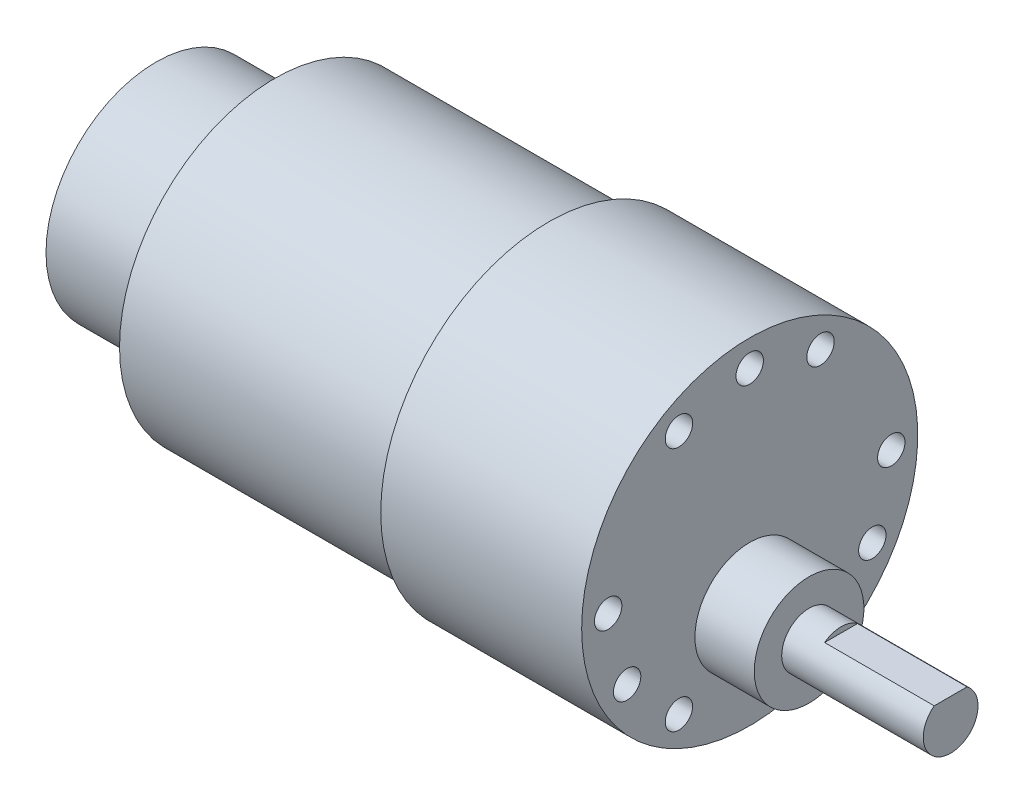
ISO-10303-21;
HEADER;
FILE_DESCRIPTION(('STEP AP214'),'2;1');
FILE_NAME('part.step','',(''),(''),'','','');
FILE_SCHEMA(('AUTOMOTIVE_DESIGN { 1 0 10303 214 1 1 1 1 }'));
ENDSEC;
DATA;
#1=APPLICATION_CONTEXT('core data for automotive mechanical design processes');
#2=APPLICATION_PROTOCOL_DEFINITION('international standard','automotive_design',2000,#1);
#3=PRODUCT_CONTEXT('',#1,'mechanical');
#4=PRODUCT('Part','Part','',(#3));
#5=PRODUCT_RELATED_PRODUCT_CATEGORY('part','',(#4));
#6=PRODUCT_DEFINITION_FORMATION('','',#4);
#7=PRODUCT_DEFINITION_CONTEXT('part definition',#1,'design');
#8=PRODUCT_DEFINITION('design','',#6,#7);
#9=PRODUCT_DEFINITION_SHAPE('','',#8);
#10=(LENGTH_UNIT() NAMED_UNIT(*) SI_UNIT(.MILLI.,.METRE.));
#11=(NAMED_UNIT(*) PLANE_ANGLE_UNIT() SI_UNIT($,.RADIAN.));
#12=(NAMED_UNIT(*) SI_UNIT($,.STERADIAN.) SOLID_ANGLE_UNIT());
#13=UNCERTAINTY_MEASURE_WITH_UNIT(LENGTH_MEASURE(1.E-05),#10,'distance_accuracy_value','');
#14=(GEOMETRIC_REPRESENTATION_CONTEXT(3) GLOBAL_UNCERTAINTY_ASSIGNED_CONTEXT((#13)) GLOBAL_UNIT_ASSIGNED_CONTEXT((#10,
#11,#12)) REPRESENTATION_CONTEXT('',''));
#15=CARTESIAN_POINT('',(0.,0.,0.));
#16=DIRECTION('',(0.,0.,1.));
#17=DIRECTION('',(1.,0.,0.));
#18=AXIS2_PLACEMENT_3D('',#15,#16,#17);
#19=CARTESIAN_POINT('',(-30.,0.,0.));
#20=DIRECTION('',(1.,0.,0.));
#21=DIRECTION('',(0.,0.,-1.));
#22=AXIS2_PLACEMENT_3D('',#19,#20,#21);
#23=PLANE('',#22);
#24=CARTESIAN_POINT('',(-30.,0.,0.));
#25=DIRECTION('',(-1.,0.,0.));
#26=DIRECTION('',(0.,0.,1.));
#27=AXIS2_PLACEMENT_3D('',#24,#25,#26);
#28=CIRCLE('',#27,17.);
#29=CARTESIAN_POINT('',(-30.,0.,17.));
#30=VERTEX_POINT('',#29);
#31=EDGE_CURVE('E91',#30,#30,#28,.T.);
#32=ORIENTED_EDGE('',*,*,#31,.T.);
#33=EDGE_LOOP('',(#32));
#34=FACE_BOUND('',#33,.T.);
#35=CARTESIAN_POINT('',(-30.,0.,0.));
#36=DIRECTION('',(1.,0.,0.));
#37=DIRECTION('',(0.,0.,-1.));
#38=AXIS2_PLACEMENT_3D('',#35,#36,#37);
#39=CIRCLE('',#38,12.05);
#40=CARTESIAN_POINT('',(-30.,0.,-12.05));
#41=VERTEX_POINT('',#40);
#42=EDGE_CURVE('E11',#41,#41,#39,.F.);
#43=ORIENTED_EDGE('',*,*,#42,.F.);
#44=EDGE_LOOP('',(#43));
#45=FACE_BOUND('',#44,.T.);
#46=ADVANCED_FACE('F32',(#34,#45),#23,.F.);
#47=CARTESIAN_POINT('',(8.41072503063725,-7.,0.));
#48=DIRECTION('',(-1.,0.,0.));
#49=DIRECTION('',(0.,0.,1.));
#50=AXIS2_PLACEMENT_3D('',#47,#48,#49);
#51=CYLINDRICAL_SURFACE('',#50,3.);
#52=CARTESIAN_POINT('',(28.5,-7.,0.));
#53=DIRECTION('',(-1.,0.,0.));
#54=DIRECTION('',(0.,0.,1.));
#55=AXIS2_PLACEMENT_3D('',#52,#53,#54);
#56=CIRCLE('',#55,3.);
#57=CARTESIAN_POINT('',(28.5,-7.,3.));
#58=VERTEX_POINT('',#57);
#59=EDGE_CURVE('E76',#58,#58,#56,.T.);
#60=ORIENTED_EDGE('',*,*,#59,.F.);
#61=EDGE_LOOP('',(#60));
#62=FACE_BOUND('',#61,.T.);
#63=DIRECTION('',(-1.,0.,0.));
#64=VECTOR('',#63,1.);
#65=CARTESIAN_POINT('',(8.41072503063725,-4.6,-1.8));
#66=LINE('',#65,#64);
#67=CARTESIAN_POINT('',(44.,-4.6,-1.8));
#68=VERTEX_POINT('',#67);
#69=CARTESIAN_POINT('',(32.,-4.6,-1.8));
#70=VERTEX_POINT('',#69);
#71=EDGE_CURVE('E64',#68,#70,#66,.T.);
#72=ORIENTED_EDGE('',*,*,#71,.F.);
#73=CARTESIAN_POINT('',(44.,-7.,0.));
#74=DIRECTION('',(-1.,0.,0.));
#75=DIRECTION('',(0.,0.,1.));
#76=AXIS2_PLACEMENT_3D('',#73,#74,#75);
#77=CIRCLE('',#76,3.);
#78=CARTESIAN_POINT('',(44.,-4.6,1.8));
#79=VERTEX_POINT('',#78);
#80=EDGE_CURVE('E70',#68,#79,#77,.T.);
#81=ORIENTED_EDGE('',*,*,#80,.T.);
#82=DIRECTION('',(-1.,0.,0.));
#83=VECTOR('',#82,1.);
#84=CARTESIAN_POINT('',(8.41072503063725,-4.6,1.8));
#85=LINE('',#84,#83);
#86=CARTESIAN_POINT('',(32.,-4.6,1.8));
#87=VERTEX_POINT('',#86);
#88=EDGE_CURVE('E47',#87,#79,#85,.F.);
#89=ORIENTED_EDGE('',*,*,#88,.F.);
#90=CARTESIAN_POINT('',(32.,-7.,0.));
#91=DIRECTION('',(1.,0.,0.));
#92=DIRECTION('',(0.,0.,-1.));
#93=AXIS2_PLACEMENT_3D('',#90,#91,#92);
#94=CIRCLE('',#93,3.);
#95=EDGE_CURVE('E40',#70,#87,#94,.T.);
#96=ORIENTED_EDGE('',*,*,#95,.F.);
#97=EDGE_LOOP('',(#72,#81,#89,#96));
#98=FACE_BOUND('',#97,.T.);
#99=ADVANCED_FACE('F68',(#62,#98),#51,.T.);
#100=CARTESIAN_POINT('',(44.,-4.00000000000001,0.));
#101=DIRECTION('',(-1.,0.,0.));
#102=DIRECTION('',(0.,0.,1.));
#103=AXIS2_PLACEMENT_3D('',#100,#101,#102);
#104=PLANE('',#103);
#105=DIRECTION('',(0.,0.,-1.));
#106=VECTOR('',#105,1.);
#107=CARTESIAN_POINT('',(44.,-4.6,0.));
#108=LINE('',#107,#106);
#109=EDGE_CURVE('E51',#79,#68,#108,.T.);
#110=ORIENTED_EDGE('',*,*,#109,.F.);
#111=ORIENTED_EDGE('',*,*,#80,.F.);
#112=EDGE_LOOP('',(#110,#111));
#113=FACE_BOUND('',#112,.T.);
#114=ADVANCED_FACE('F105',(#113),#104,.F.);
#115=CARTESIAN_POINT('',(22.,18.4,0.));
#116=DIRECTION('',(-1.,0.,0.));
#117=DIRECTION('',(0.,0.,1.));
#118=AXIS2_PLACEMENT_3D('',#115,#116,#117);
#119=PLANE('',#118);
#120=CARTESIAN_POINT('',(22.,-13.4233937586587,7.7500000000002));
#121=DIRECTION('',(1.,0.,0.));
#122=DIRECTION('',(0.,0.866025403784443,0.499999999999992));
#123=AXIS2_PLACEMENT_3D('',#120,#121,#122);
#124=CIRCLE('',#123,1.5);
#125=CARTESIAN_POINT('',(22.,-12.124355652982,8.50000000000019));
#126=VERTEX_POINT('',#125);
#127=EDGE_CURVE('E444',#126,#126,#124,.T.);
#128=ORIENTED_EDGE('',*,*,#127,.F.);
#129=EDGE_LOOP('',(#128));
#130=FACE_BOUND('',#129,.T.);
#131=CARTESIAN_POINT('',(22.,0.,15.5));
#132=DIRECTION('',(1.,0.,0.));
#133=DIRECTION('',(0.,0.866025403784443,0.499999999999992));
#134=AXIS2_PLACEMENT_3D('',#131,#132,#133);
#135=CIRCLE('',#134,1.5);
#136=CARTESIAN_POINT('',(22.,1.29903810567671,16.25));
#137=VERTEX_POINT('',#136);
#138=EDGE_CURVE('E443',#137,#137,#135,.T.);
#139=ORIENTED_EDGE('',*,*,#138,.F.);
#140=EDGE_LOOP('',(#139));
#141=FACE_BOUND('',#140,.T.);
#142=CARTESIAN_POINT('',(22.,-7.74999999999987,13.4233937586589));
#143=DIRECTION('',(1.,0.,0.));
#144=DIRECTION('',(0.,0.866025403784443,0.499999999999992));
#145=AXIS2_PLACEMENT_3D('',#142,#143,#144);
#146=CIRCLE('',#145,1.5);
#147=CARTESIAN_POINT('',(22.,-6.45096189432321,14.1733937586589));
#148=VERTEX_POINT('',#147);
#149=EDGE_CURVE('E453',#148,#148,#146,.T.);
#150=ORIENTED_EDGE('',*,*,#149,.F.);
#151=EDGE_LOOP('',(#150));
#152=FACE_BOUND('',#151,.T.);
#153=CARTESIAN_POINT('',(22.,-1.60461921527855E-13,-15.5));
#154=DIRECTION('',(1.,0.,0.));
#155=DIRECTION('',(0.,-0.866025403784436,0.500000000000004));
#156=AXIS2_PLACEMENT_3D('',#153,#154,#155);
#157=CIRCLE('',#156,1.5);
#158=CARTESIAN_POINT('',(22.,-1.29903810567682,-14.75));
#159=VERTEX_POINT('',#158);
#160=EDGE_CURVE('E458',#159,#159,#157,.T.);
#161=ORIENTED_EDGE('',*,*,#160,.F.);
#162=EDGE_LOOP('',(#161));
#163=FACE_BOUND('',#162,.T.);
#164=CARTESIAN_POINT('',(22.,-13.4233937586588,-7.75000000000002));
#165=DIRECTION('',(1.,0.,0.));
#166=DIRECTION('',(0.,-0.866025403784436,0.500000000000004));
#167=AXIS2_PLACEMENT_3D('',#164,#165,#166);
#168=CIRCLE('',#167,1.5);
#169=CARTESIAN_POINT('',(22.,-14.7224318643354,-7.00000000000002));
#170=VERTEX_POINT('',#169);
#171=EDGE_CURVE('E464',#170,#170,#168,.T.);
#172=ORIENTED_EDGE('',*,*,#171,.F.);
#173=EDGE_LOOP('',(#172));
#174=FACE_BOUND('',#173,.T.);
#175=CARTESIAN_POINT('',(22.,-7.75000000000006,-13.4233937586588));
#176=DIRECTION('',(1.,0.,0.));
#177=DIRECTION('',(0.,-0.866025403784436,0.500000000000004));
#178=AXIS2_PLACEMENT_3D('',#175,#176,#177);
#179=CIRCLE('',#178,1.5);
#180=CARTESIAN_POINT('',(22.,-9.04903810567672,-12.6733937586588));
#181=VERTEX_POINT('',#180);
#182=EDGE_CURVE('E470',#181,#181,#179,.T.);
#183=ORIENTED_EDGE('',*,*,#182,.F.);
#184=EDGE_LOOP('',(#183));
#185=FACE_BOUND('',#184,.T.);
#186=CARTESIAN_POINT('',(22.,13.4233937586588,7.74999999999992));
#187=DIRECTION('',(1.,0.,0.));
#188=DIRECTION('',(0.,0.,-1.));
#189=AXIS2_PLACEMENT_3D('',#186,#187,#188);
#190=CIRCLE('',#189,1.5);
#191=CARTESIAN_POINT('',(22.,13.4233937586588,6.24999999999992));
#192=VERTEX_POINT('',#191);
#193=EDGE_CURVE('E476',#192,#192,#190,.T.);
#194=ORIENTED_EDGE('',*,*,#193,.F.);
#195=EDGE_LOOP('',(#194));
#196=FACE_BOUND('',#195,.T.);
#197=CARTESIAN_POINT('',(22.,13.4233937586588,-7.74999999999992));
#198=DIRECTION('',(1.,0.,0.));
#199=DIRECTION('',(0.,0.,-1.));
#200=AXIS2_PLACEMENT_3D('',#197,#198,#199);
#201=CIRCLE('',#200,1.5);
#202=CARTESIAN_POINT('',(22.,13.4233937586588,-9.24999999999992));
#203=VERTEX_POINT('',#202);
#204=EDGE_CURVE('E482',#203,#203,#201,.T.);
#205=ORIENTED_EDGE('',*,*,#204,.F.);
#206=EDGE_LOOP('',(#205));
#207=FACE_BOUND('',#206,.T.);
#208=CARTESIAN_POINT('',(22.,15.5,0.));
#209=DIRECTION('',(1.,0.,0.));
#210=DIRECTION('',(0.,0.,-1.));
#211=AXIS2_PLACEMENT_3D('',#208,#209,#210);
#212=CIRCLE('',#211,1.5);
#213=CARTESIAN_POINT('',(22.,15.5,-1.5));
#214=VERTEX_POINT('',#213);
#215=EDGE_CURVE('E152',#214,#214,#212,.T.);
#216=ORIENTED_EDGE('',*,*,#215,.F.);
#217=EDGE_LOOP('',(#216));
#218=FACE_BOUND('',#217,.T.);
#219=CARTESIAN_POINT('',(22.,0.,0.));
#220=DIRECTION('',(-1.,0.,0.));
#221=DIRECTION('',(0.,0.,1.));
#222=AXIS2_PLACEMENT_3D('',#219,#220,#221);
#223=CIRCLE('',#222,18.4);
#224=CARTESIAN_POINT('',(22.,0.,18.4));
#225=VERTEX_POINT('',#224);
#226=EDGE_CURVE('E82',#225,#225,#223,.T.);
#227=ORIENTED_EDGE('',*,*,#226,.F.);
#228=EDGE_LOOP('',(#227));
#229=FACE_BOUND('',#228,.T.);
#230=CARTESIAN_POINT('',(22.,-7.,0.));
#231=DIRECTION('',(-1.,0.,0.));
#232=DIRECTION('',(0.,0.,1.));
#233=AXIS2_PLACEMENT_3D('',#230,#231,#232);
#234=CIRCLE('',#233,6.);
#235=CARTESIAN_POINT('',(22.,-7.,6.));
#236=VERTEX_POINT('',#235);
#237=EDGE_CURVE('E94',#236,#236,#234,.F.);
#238=ORIENTED_EDGE('',*,*,#237,.F.);
#239=EDGE_LOOP('',(#238));
#240=FACE_BOUND('',#239,.T.);
#241=ADVANCED_FACE('F102',(#130,#141,#152,#163,#174,#185,#196,#207,#218,#229,#240),#119,.F.);
#242=CARTESIAN_POINT('',(-59.1178385416667,0.,0.));
#243=DIRECTION('',(-1.,0.,0.));
#244=DIRECTION('',(0.,0.,1.));
#245=AXIS2_PLACEMENT_3D('',#242,#243,#244);
#246=CYLINDRICAL_SURFACE('',#245,17.);
#247=ORIENTED_EDGE('',*,*,#31,.F.);
#248=EDGE_LOOP('',(#247));
#249=FACE_BOUND('',#248,.T.);
#250=CARTESIAN_POINT('',(0.,0.,0.));
#251=DIRECTION('',(-1.,0.,0.));
#252=DIRECTION('',(0.,0.,1.));
#253=AXIS2_PLACEMENT_3D('',#250,#251,#252);
#254=CIRCLE('',#253,17.);
#255=CARTESIAN_POINT('',(0.,0.,17.));
#256=VERTEX_POINT('',#255);
#257=EDGE_CURVE('E88',#256,#256,#254,.T.);
#258=ORIENTED_EDGE('',*,*,#257,.T.);
#259=EDGE_LOOP('',(#258));
#260=FACE_BOUND('',#259,.T.);
#261=ADVANCED_FACE('F104',(#249,#260),#246,.T.);
#262=CARTESIAN_POINT('',(0.,17.,0.));
#263=DIRECTION('',(1.,0.,0.));
#264=DIRECTION('',(0.,0.,-1.));
#265=AXIS2_PLACEMENT_3D('',#262,#263,#264);
#266=PLANE('',#265);
#267=ORIENTED_EDGE('',*,*,#257,.F.);
#268=EDGE_LOOP('',(#267));
#269=FACE_BOUND('',#268,.T.);
#270=CARTESIAN_POINT('',(0.,0.,0.));
#271=DIRECTION('',(-1.,0.,0.));
#272=DIRECTION('',(0.,0.,1.));
#273=AXIS2_PLACEMENT_3D('',#270,#271,#272);
#274=CIRCLE('',#273,18.4);
#275=CARTESIAN_POINT('',(0.,0.,18.4));
#276=VERTEX_POINT('',#275);
#277=EDGE_CURVE('E85',#276,#276,#274,.T.);
#278=ORIENTED_EDGE('',*,*,#277,.T.);
#279=EDGE_LOOP('',(#278));
#280=FACE_BOUND('',#279,.T.);
#281=ADVANCED_FACE('F112',(#269,#280),#266,.F.);
#282=CARTESIAN_POINT('',(-59.1178385416667,0.,0.));
#283=DIRECTION('',(-1.,0.,0.));
#284=DIRECTION('',(0.,0.,1.));
#285=AXIS2_PLACEMENT_3D('',#282,#283,#284);
#286=CYLINDRICAL_SURFACE('',#285,18.4);
#287=ORIENTED_EDGE('',*,*,#277,.F.);
#288=EDGE_LOOP('',(#287));
#289=FACE_BOUND('',#288,.T.);
#290=ORIENTED_EDGE('',*,*,#226,.T.);
#291=EDGE_LOOP('',(#290));
#292=FACE_BOUND('',#291,.T.);
#293=ADVANCED_FACE('F178',(#289,#292),#286,.T.);
#294=CARTESIAN_POINT('',(8.41072503063725,-7.,0.));
#295=DIRECTION('',(-1.,0.,0.));
#296=DIRECTION('',(0.,0.,1.));
#297=AXIS2_PLACEMENT_3D('',#294,#295,#296);
#298=CYLINDRICAL_SURFACE('',#297,6.);
#299=ORIENTED_EDGE('',*,*,#237,.T.);
#300=EDGE_LOOP('',(#299));
#301=FACE_BOUND('',#300,.T.);
#302=CARTESIAN_POINT('',(28.5,-7.,0.));
#303=DIRECTION('',(-1.,0.,0.));
#304=DIRECTION('',(0.,0.,1.));
#305=AXIS2_PLACEMENT_3D('',#302,#303,#304);
#306=CIRCLE('',#305,6.);
#307=CARTESIAN_POINT('',(28.5,-7.,6.));
#308=VERTEX_POINT('',#307);
#309=EDGE_CURVE('E79',#308,#308,#306,.T.);
#310=ORIENTED_EDGE('',*,*,#309,.T.);
#311=EDGE_LOOP('',(#310));
#312=FACE_BOUND('',#311,.T.);
#313=ADVANCED_FACE('F99',(#301,#312),#298,.T.);
#314=CARTESIAN_POINT('',(28.5,-1.,0.));
#315=DIRECTION('',(-1.,0.,0.));
#316=DIRECTION('',(0.,0.,1.));
#317=AXIS2_PLACEMENT_3D('',#314,#315,#316);
#318=PLANE('',#317);
#319=ORIENTED_EDGE('',*,*,#309,.F.);
#320=EDGE_LOOP('',(#319));
#321=FACE_BOUND('',#320,.T.);
#322=ORIENTED_EDGE('',*,*,#59,.T.);
#323=EDGE_LOOP('',(#322));
#324=FACE_BOUND('',#323,.T.);
#325=ADVANCED_FACE('F173',(#321,#324),#318,.F.);
#326=CARTESIAN_POINT('',(32.,6.87018499999999,10.));
#327=DIRECTION('',(1.,0.,0.));
#328=DIRECTION('',(0.,0.,-1.));
#329=AXIS2_PLACEMENT_3D('',#326,#327,#328);
#330=PLANE('',#329);
#331=ORIENTED_EDGE('',*,*,#95,.T.);
#332=DIRECTION('',(0.,0.,-1.));
#333=VECTOR('',#332,1.);
#334=CARTESIAN_POINT('',(32.,-4.6,10.));
#335=LINE('',#334,#333);
#336=EDGE_CURVE('E61',#87,#70,#335,.T.);
#337=ORIENTED_EDGE('',*,*,#336,.T.);
#338=EDGE_LOOP('',(#331,#337));
#339=FACE_BOUND('',#338,.T.);
#340=ADVANCED_FACE('F60',(#339),#330,.T.);
#341=CARTESIAN_POINT('',(32.,-4.6,10.));
#342=DIRECTION('',(0.,1.,0.));
#343=DIRECTION('',(0.,0.,1.));
#344=AXIS2_PLACEMENT_3D('',#341,#342,#343);
#345=PLANE('',#344);
#346=ORIENTED_EDGE('',*,*,#71,.T.);
#347=ORIENTED_EDGE('',*,*,#336,.F.);
#348=ORIENTED_EDGE('',*,*,#88,.T.);
#349=ORIENTED_EDGE('',*,*,#109,.T.);
#350=EDGE_LOOP('',(#346,#347,#348,#349));
#351=FACE_BOUND('',#350,.T.);
#352=ADVANCED_FACE('F63',(#351),#345,.T.);
#353=CARTESIAN_POINT('',(-43.,0.,0.));
#354=DIRECTION('',(-1.,0.,0.));
#355=DIRECTION('',(0.,0.,1.));
#356=AXIS2_PLACEMENT_3D('',#353,#354,#355);
#357=PLANE('',#356);
#358=CARTESIAN_POINT('',(-43.,0.,0.));
#359=DIRECTION('',(-1.,0.,0.));
#360=DIRECTION('',(0.,0.,1.));
#361=AXIS2_PLACEMENT_3D('',#358,#359,#360);
#362=CIRCLE('',#361,12.05);
#363=CARTESIAN_POINT('',(-43.,0.,12.05));
#364=VERTEX_POINT('',#363);
#365=EDGE_CURVE('E65',#364,#364,#362,.T.);
#366=ORIENTED_EDGE('',*,*,#365,.T.);
#367=EDGE_LOOP('',(#366));
#368=FACE_BOUND('',#367,.T.);
#369=CARTESIAN_POINT('',(-43.,0.,0.));
#370=DIRECTION('',(-1.,0.,0.));
#371=DIRECTION('',(0.,0.,1.));
#372=AXIS2_PLACEMENT_3D('',#369,#370,#371);
#373=CIRCLE('',#372,11.9);
#374=CARTESIAN_POINT('',(-43.,0.,11.9));
#375=VERTEX_POINT('',#374);
#376=EDGE_CURVE('E146',#375,#375,#373,.T.);
#377=ORIENTED_EDGE('',*,*,#376,.F.);
#378=EDGE_LOOP('',(#377));
#379=FACE_BOUND('',#378,.T.);
#380=ADVANCED_FACE('F158',(#368,#379),#357,.T.);
#381=CARTESIAN_POINT('',(-43.,0.,0.));
#382=DIRECTION('',(1.,0.,0.));
#383=DIRECTION('',(0.,0.,-1.));
#384=AXIS2_PLACEMENT_3D('',#381,#382,#383);
#385=CYLINDRICAL_SURFACE('',#384,12.05);
#386=ORIENTED_EDGE('',*,*,#365,.F.);
#387=EDGE_LOOP('',(#386));
#388=FACE_BOUND('',#387,.T.);
#389=ORIENTED_EDGE('',*,*,#42,.T.);
#390=EDGE_LOOP('',(#389));
#391=FACE_BOUND('',#390,.T.);
#392=ADVANCED_FACE('F139',(#388,#391),#385,.T.);
#393=CARTESIAN_POINT('',(-43.,0.,0.));
#394=DIRECTION('',(1.,0.,0.));
#395=DIRECTION('',(0.,0.,-1.));
#396=AXIS2_PLACEMENT_3D('',#393,#394,#395);
#397=CYLINDRICAL_SURFACE('',#396,11.9);
#398=ORIENTED_EDGE('',*,*,#376,.T.);
#399=EDGE_LOOP('',(#398));
#400=FACE_BOUND('',#399,.T.);
#401=CARTESIAN_POINT('',(-30.,0.,0.));
#402=DIRECTION('',(-1.,0.,0.));
#403=DIRECTION('',(0.,0.,1.));
#404=AXIS2_PLACEMENT_3D('',#401,#402,#403);
#405=CIRCLE('',#404,11.9);
#406=CARTESIAN_POINT('',(-30.,0.,11.9));
#407=VERTEX_POINT('',#406);
#408=EDGE_CURVE('E144',#407,#407,#405,.T.);
#409=ORIENTED_EDGE('',*,*,#408,.F.);
#410=EDGE_LOOP('',(#409));
#411=FACE_BOUND('',#410,.T.);
#412=ADVANCED_FACE('F130',(#400,#411),#397,.F.);
#413=ORIENTED_EDGE('',*,*,#408,.T.);
#414=EDGE_LOOP('',(#413));
#415=FACE_BOUND('',#414,.T.);
#416=ADVANCED_FACE('F34',(#415),#23,.F.);
#417=CARTESIAN_POINT('',(17.,15.5,0.));
#418=DIRECTION('',(1.,0.,0.));
#419=DIRECTION('',(0.,0.,-1.));
#420=AXIS2_PLACEMENT_3D('',#417,#418,#419);
#421=CYLINDRICAL_SURFACE('',#420,1.5);
#422=CARTESIAN_POINT('',(17.,15.5,0.));
#423=DIRECTION('',(1.,0.,0.));
#424=DIRECTION('',(0.,0.,-1.));
#425=AXIS2_PLACEMENT_3D('',#422,#423,#424);
#426=CIRCLE('',#425,1.5);
#427=CARTESIAN_POINT('',(17.,15.5,-1.5));
#428=VERTEX_POINT('',#427);
#429=EDGE_CURVE('E147',#428,#428,#426,.T.);
#430=ORIENTED_EDGE('',*,*,#429,.F.);
#431=EDGE_LOOP('',(#430));
#432=FACE_BOUND('',#431,.T.);
#433=ORIENTED_EDGE('',*,*,#215,.T.);
#434=EDGE_LOOP('',(#433));
#435=FACE_BOUND('',#434,.T.);
#436=ADVANCED_FACE('F129',(#432,#435),#421,.F.);
#437=CARTESIAN_POINT('',(17.,15.5,0.));
#438=DIRECTION('',(1.,0.,0.));
#439=DIRECTION('',(0.,0.,-1.));
#440=AXIS2_PLACEMENT_3D('',#437,#438,#439);
#441=PLANE('',#440);
#442=ORIENTED_EDGE('',*,*,#429,.T.);
#443=EDGE_LOOP('',(#442));
#444=FACE_BOUND('',#443,.T.);
#445=ADVANCED_FACE('F136',(#444),#441,.T.);
#446=CARTESIAN_POINT('',(17.,13.4233937586588,-7.74999999999992));
#447=DIRECTION('',(1.,0.,0.));
#448=DIRECTION('',(0.,0.,-1.));
#449=AXIS2_PLACEMENT_3D('',#446,#447,#448);
#450=CYLINDRICAL_SURFACE('',#449,1.5);
#451=CARTESIAN_POINT('',(17.,13.4233937586588,-7.74999999999992));
#452=DIRECTION('',(1.,0.,0.));
#453=DIRECTION('',(0.,0.,-1.));
#454=AXIS2_PLACEMENT_3D('',#451,#452,#453);
#455=CIRCLE('',#454,1.5);
#456=CARTESIAN_POINT('',(17.,13.4233937586588,-9.24999999999992));
#457=VERTEX_POINT('',#456);
#458=EDGE_CURVE('E485',#457,#457,#455,.T.);
#459=ORIENTED_EDGE('',*,*,#458,.F.);
#460=EDGE_LOOP('',(#459));
#461=FACE_BOUND('',#460,.T.);
#462=ORIENTED_EDGE('',*,*,#204,.T.);
#463=EDGE_LOOP('',(#462));
#464=FACE_BOUND('',#463,.T.);
#465=ADVANCED_FACE('F278',(#461,#464),#450,.F.);
#466=CARTESIAN_POINT('',(17.,13.4233937586588,-7.74999999999992));
#467=DIRECTION('',(1.,0.,0.));
#468=DIRECTION('',(0.,0.,-1.));
#469=AXIS2_PLACEMENT_3D('',#466,#467,#468);
#470=PLANE('',#469);
#471=ORIENTED_EDGE('',*,*,#458,.T.);
#472=EDGE_LOOP('',(#471));
#473=FACE_BOUND('',#472,.T.);
#474=ADVANCED_FACE('F287',(#473),#470,.T.);
#475=CARTESIAN_POINT('',(17.,13.4233937586588,7.74999999999992));
#476=DIRECTION('',(1.,0.,0.));
#477=DIRECTION('',(0.,0.,-1.));
#478=AXIS2_PLACEMENT_3D('',#475,#476,#477);
#479=CYLINDRICAL_SURFACE('',#478,1.5);
#480=CARTESIAN_POINT('',(17.,13.4233937586588,7.74999999999992));
#481=DIRECTION('',(1.,0.,0.));
#482=DIRECTION('',(0.,0.,-1.));
#483=AXIS2_PLACEMENT_3D('',#480,#481,#482);
#484=CIRCLE('',#483,1.5);
#485=CARTESIAN_POINT('',(17.,13.4233937586588,6.24999999999992));
#486=VERTEX_POINT('',#485);
#487=EDGE_CURVE('E479',#486,#486,#484,.T.);
#488=ORIENTED_EDGE('',*,*,#487,.F.);
#489=EDGE_LOOP('',(#488));
#490=FACE_BOUND('',#489,.T.);
#491=ORIENTED_EDGE('',*,*,#193,.T.);
#492=EDGE_LOOP('',(#491));
#493=FACE_BOUND('',#492,.T.);
#494=ADVANCED_FACE('F296',(#490,#493),#479,.F.);
#495=CARTESIAN_POINT('',(17.,13.4233937586588,7.74999999999992));
#496=DIRECTION('',(1.,0.,0.));
#497=DIRECTION('',(0.,0.,-1.));
#498=AXIS2_PLACEMENT_3D('',#495,#496,#497);
#499=PLANE('',#498);
#500=ORIENTED_EDGE('',*,*,#487,.T.);
#501=EDGE_LOOP('',(#500));
#502=FACE_BOUND('',#501,.T.);
#503=ADVANCED_FACE('F305',(#502),#499,.T.);
#504=CARTESIAN_POINT('',(17.,-7.75000000000006,-13.4233937586588));
#505=DIRECTION('',(1.,0.,0.));
#506=DIRECTION('',(0.,0.,-1.));
#507=AXIS2_PLACEMENT_3D('',#504,#505,#506);
#508=CYLINDRICAL_SURFACE('',#507,1.5);
#509=CARTESIAN_POINT('',(17.,-7.75000000000006,-13.4233937586588));
#510=DIRECTION('',(1.,0.,0.));
#511=DIRECTION('',(0.,-0.866025403784436,0.500000000000004));
#512=AXIS2_PLACEMENT_3D('',#509,#510,#511);
#513=CIRCLE('',#512,1.5);
#514=CARTESIAN_POINT('',(17.,-9.04903810567672,-12.6733937586588));
#515=VERTEX_POINT('',#514);
#516=EDGE_CURVE('E473',#515,#515,#513,.T.);
#517=ORIENTED_EDGE('',*,*,#516,.F.);
#518=EDGE_LOOP('',(#517));
#519=FACE_BOUND('',#518,.T.);
#520=ORIENTED_EDGE('',*,*,#182,.T.);
#521=EDGE_LOOP('',(#520));
#522=FACE_BOUND('',#521,.T.);
#523=ADVANCED_FACE('F313',(#519,#522),#508,.F.);
#524=CARTESIAN_POINT('',(17.,-7.75000000000006,-13.4233937586588));
#525=DIRECTION('',(1.,0.,0.));
#526=DIRECTION('',(0.,-0.866025403784436,0.500000000000004));
#527=AXIS2_PLACEMENT_3D('',#524,#525,#526);
#528=PLANE('',#527);
#529=ORIENTED_EDGE('',*,*,#516,.T.);
#530=EDGE_LOOP('',(#529));
#531=FACE_BOUND('',#530,.T.);
#532=ADVANCED_FACE('F321',(#531),#528,.T.);
#533=CARTESIAN_POINT('',(17.,-13.4233937586588,-7.75000000000002));
#534=DIRECTION('',(1.,0.,0.));
#535=DIRECTION('',(0.,0.,-1.));
#536=AXIS2_PLACEMENT_3D('',#533,#534,#535);
#537=CYLINDRICAL_SURFACE('',#536,1.5);
#538=CARTESIAN_POINT('',(17.,-13.4233937586588,-7.75000000000002));
#539=DIRECTION('',(1.,0.,0.));
#540=DIRECTION('',(0.,-0.866025403784436,0.500000000000004));
#541=AXIS2_PLACEMENT_3D('',#538,#539,#540);
#542=CIRCLE('',#541,1.5);
#543=CARTESIAN_POINT('',(17.,-14.7224318643354,-7.00000000000002));
#544=VERTEX_POINT('',#543);
#545=EDGE_CURVE('E467',#544,#544,#542,.T.);
#546=ORIENTED_EDGE('',*,*,#545,.F.);
#547=EDGE_LOOP('',(#546));
#548=FACE_BOUND('',#547,.T.);
#549=ORIENTED_EDGE('',*,*,#171,.T.);
#550=EDGE_LOOP('',(#549));
#551=FACE_BOUND('',#550,.T.);
#552=ADVANCED_FACE('F330',(#548,#551),#537,.F.);
#553=CARTESIAN_POINT('',(17.,-13.4233937586588,-7.75000000000002));
#554=DIRECTION('',(1.,0.,0.));
#555=DIRECTION('',(0.,-0.866025403784436,0.500000000000004));
#556=AXIS2_PLACEMENT_3D('',#553,#554,#555);
#557=PLANE('',#556);
#558=ORIENTED_EDGE('',*,*,#545,.T.);
#559=EDGE_LOOP('',(#558));
#560=FACE_BOUND('',#559,.T.);
#561=ADVANCED_FACE('F339',(#560),#557,.T.);
#562=CARTESIAN_POINT('',(17.,-1.60461921527855E-13,-15.5));
#563=DIRECTION('',(1.,0.,0.));
#564=DIRECTION('',(0.,0.,-1.));
#565=AXIS2_PLACEMENT_3D('',#562,#563,#564);
#566=CYLINDRICAL_SURFACE('',#565,1.5);
#567=CARTESIAN_POINT('',(17.,-1.60461921527855E-13,-15.5));
#568=DIRECTION('',(1.,0.,0.));
#569=DIRECTION('',(0.,-0.866025403784436,0.500000000000004));
#570=AXIS2_PLACEMENT_3D('',#567,#568,#569);
#571=CIRCLE('',#570,1.5);
#572=CARTESIAN_POINT('',(17.,-1.29903810567682,-14.75));
#573=VERTEX_POINT('',#572);
#574=EDGE_CURVE('E461',#573,#573,#571,.T.);
#575=ORIENTED_EDGE('',*,*,#574,.F.);
#576=EDGE_LOOP('',(#575));
#577=FACE_BOUND('',#576,.T.);
#578=ORIENTED_EDGE('',*,*,#160,.T.);
#579=EDGE_LOOP('',(#578));
#580=FACE_BOUND('',#579,.T.);
#581=ADVANCED_FACE('F348',(#577,#580),#566,.F.);
#582=CARTESIAN_POINT('',(17.,-1.60461921527855E-13,-15.5));
#583=DIRECTION('',(1.,0.,0.));
#584=DIRECTION('',(0.,-0.866025403784436,0.500000000000004));
#585=AXIS2_PLACEMENT_3D('',#582,#583,#584);
#586=PLANE('',#585);
#587=ORIENTED_EDGE('',*,*,#574,.T.);
#588=EDGE_LOOP('',(#587));
#589=FACE_BOUND('',#588,.T.);
#590=ADVANCED_FACE('F357',(#589),#586,.T.);
#591=CARTESIAN_POINT('',(17.,-7.74999999999987,13.4233937586589));
#592=DIRECTION('',(1.,0.,0.));
#593=DIRECTION('',(0.,0.,-1.));
#594=AXIS2_PLACEMENT_3D('',#591,#592,#593);
#595=CYLINDRICAL_SURFACE('',#594,1.5);
#596=CARTESIAN_POINT('',(17.,-7.74999999999987,13.4233937586589));
#597=DIRECTION('',(1.,0.,0.));
#598=DIRECTION('',(0.,0.866025403784443,0.499999999999992));
#599=AXIS2_PLACEMENT_3D('',#596,#597,#598);
#600=CIRCLE('',#599,1.5);
#601=CARTESIAN_POINT('',(17.,-6.45096189432321,14.1733937586589));
#602=VERTEX_POINT('',#601);
#603=EDGE_CURVE('E455',#602,#602,#600,.T.);
#604=ORIENTED_EDGE('',*,*,#603,.F.);
#605=EDGE_LOOP('',(#604));
#606=FACE_BOUND('',#605,.T.);
#607=ORIENTED_EDGE('',*,*,#149,.T.);
#608=EDGE_LOOP('',(#607));
#609=FACE_BOUND('',#608,.T.);
#610=ADVANCED_FACE('F366',(#606,#609),#595,.F.);
#611=CARTESIAN_POINT('',(17.,-7.74999999999987,13.4233937586589));
#612=DIRECTION('',(1.,0.,0.));
#613=DIRECTION('',(0.,0.866025403784443,0.499999999999992));
#614=AXIS2_PLACEMENT_3D('',#611,#612,#613);
#615=PLANE('',#614);
#616=ORIENTED_EDGE('',*,*,#603,.T.);
#617=EDGE_LOOP('',(#616));
#618=FACE_BOUND('',#617,.T.);
#619=ADVANCED_FACE('F375',(#618),#615,.T.);
#620=CARTESIAN_POINT('',(17.,0.,15.5));
#621=DIRECTION('',(1.,0.,0.));
#622=DIRECTION('',(0.,0.,-1.));
#623=AXIS2_PLACEMENT_3D('',#620,#621,#622);
#624=CYLINDRICAL_SURFACE('',#623,1.5);
#625=CARTESIAN_POINT('',(17.,0.,15.5));
#626=DIRECTION('',(1.,0.,0.));
#627=DIRECTION('',(0.,0.866025403784443,0.499999999999992));
#628=AXIS2_PLACEMENT_3D('',#625,#626,#627);
#629=CIRCLE('',#628,1.5);
#630=CARTESIAN_POINT('',(17.,1.29903810567671,16.25));
#631=VERTEX_POINT('',#630);
#632=EDGE_CURVE('E447',#631,#631,#629,.T.);
#633=ORIENTED_EDGE('',*,*,#632,.F.);
#634=EDGE_LOOP('',(#633));
#635=FACE_BOUND('',#634,.T.);
#636=ORIENTED_EDGE('',*,*,#138,.T.);
#637=EDGE_LOOP('',(#636));
#638=FACE_BOUND('',#637,.T.);
#639=ADVANCED_FACE('F384',(#635,#638),#624,.F.);
#640=CARTESIAN_POINT('',(17.,0.,15.5));
#641=DIRECTION('',(1.,0.,0.));
#642=DIRECTION('',(0.,0.866025403784443,0.499999999999992));
#643=AXIS2_PLACEMENT_3D('',#640,#641,#642);
#644=PLANE('',#643);
#645=ORIENTED_EDGE('',*,*,#632,.T.);
#646=EDGE_LOOP('',(#645));
#647=FACE_BOUND('',#646,.T.);
#648=ADVANCED_FACE('F393',(#647),#644,.T.);
#649=CARTESIAN_POINT('',(17.,-13.4233937586587,7.7500000000002));
#650=DIRECTION('',(1.,0.,0.));
#651=DIRECTION('',(0.,0.,-1.));
#652=AXIS2_PLACEMENT_3D('',#649,#650,#651);
#653=CYLINDRICAL_SURFACE('',#652,1.5);
#654=CARTESIAN_POINT('',(17.,-13.4233937586587,7.7500000000002));
#655=DIRECTION('',(1.,0.,0.));
#656=DIRECTION('',(0.,0.866025403784443,0.499999999999992));
#657=AXIS2_PLACEMENT_3D('',#654,#655,#656);
#658=CIRCLE('',#657,1.5);
#659=CARTESIAN_POINT('',(17.,-12.124355652982,8.50000000000019));
#660=VERTEX_POINT('',#659);
#661=EDGE_CURVE('E442',#660,#660,#658,.T.);
#662=ORIENTED_EDGE('',*,*,#661,.F.);
#663=EDGE_LOOP('',(#662));
#664=FACE_BOUND('',#663,.T.);
#665=ORIENTED_EDGE('',*,*,#127,.T.);
#666=EDGE_LOOP('',(#665));
#667=FACE_BOUND('',#666,.T.);
#668=ADVANCED_FACE('F402',(#664,#667),#653,.F.);
#669=CARTESIAN_POINT('',(17.,-13.4233937586587,7.7500000000002));
#670=DIRECTION('',(1.,0.,0.));
#671=DIRECTION('',(0.,0.866025403784443,0.499999999999992));
#672=AXIS2_PLACEMENT_3D('',#669,#670,#671);
#673=PLANE('',#672);
#674=ORIENTED_EDGE('',*,*,#661,.T.);
#675=EDGE_LOOP('',(#674));
#676=FACE_BOUND('',#675,.T.);
#677=ADVANCED_FACE('F411',(#676),#673,.T.);
#678=CLOSED_SHELL('',(#46,#99,#114,#241,#261,#281,#293,#313,#325,#340,#352,#380,#392,#412,#416,
#436,#445,#465,#474,#494,#503,#523,#532,#552,#561,#581,#590,#610,#619,#639,#648,#668,#677));
#679=MANIFOLD_SOLID_BREP('B2',#678);
#680=ADVANCED_BREP_SHAPE_REPRESENTATION('',(#18,#679),#14);
#681=SHAPE_DEFINITION_REPRESENTATION(#9,#680);
ENDSEC;
END-ISO-10303-21;
